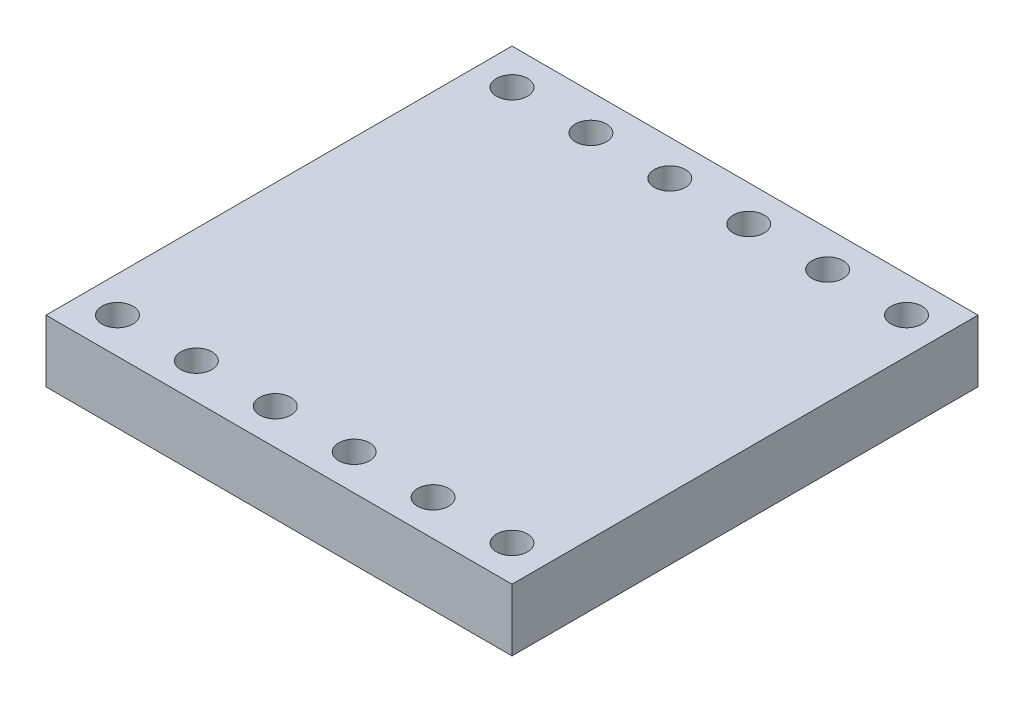
ISO-10303-21;
HEADER;
FILE_DESCRIPTION(('STEP AP214'),'2;1');
FILE_NAME('part.step','',(''),(''),'','','');
FILE_SCHEMA(('AUTOMOTIVE_DESIGN { 1 0 10303 214 1 1 1 1 }'));
ENDSEC;
DATA;
#1=APPLICATION_CONTEXT('core data for automotive mechanical design processes');
#2=APPLICATION_PROTOCOL_DEFINITION('international standard','automotive_design',2000,#1);
#3=PRODUCT_CONTEXT('',#1,'mechanical');
#4=PRODUCT('Part','Part','',(#3));
#5=PRODUCT_RELATED_PRODUCT_CATEGORY('part','',(#4));
#6=PRODUCT_DEFINITION_FORMATION('','',#4);
#7=PRODUCT_DEFINITION_CONTEXT('part definition',#1,'design');
#8=PRODUCT_DEFINITION('design','',#6,#7);
#9=PRODUCT_DEFINITION_SHAPE('','',#8);
#10=(LENGTH_UNIT() NAMED_UNIT(*) SI_UNIT(.MILLI.,.METRE.));
#11=(NAMED_UNIT(*) PLANE_ANGLE_UNIT() SI_UNIT($,.RADIAN.));
#12=(NAMED_UNIT(*) SI_UNIT($,.STERADIAN.) SOLID_ANGLE_UNIT());
#13=UNCERTAINTY_MEASURE_WITH_UNIT(LENGTH_MEASURE(1.E-05),#10,'distance_accuracy_value','');
#14=(GEOMETRIC_REPRESENTATION_CONTEXT(3) GLOBAL_UNCERTAINTY_ASSIGNED_CONTEXT((#13)) GLOBAL_UNIT_ASSIGNED_CONTEXT((#10,
#11,#12)) REPRESENTATION_CONTEXT('',''));
#15=CARTESIAN_POINT('',(0.,0.,0.));
#16=DIRECTION('',(0.,0.,1.));
#17=DIRECTION('',(1.,0.,0.));
#18=AXIS2_PLACEMENT_3D('',#15,#16,#17);
#19=CARTESIAN_POINT('',(0.,2.,0.));
#20=DIRECTION('',(1.,0.,0.));
#21=DIRECTION('',(0.,0.,-1.));
#22=AXIS2_PLACEMENT_3D('',#19,#20,#21);
#23=PLANE('',#22);
#24=DIRECTION('',(0.,0.,1.));
#25=VECTOR('',#24,1.);
#26=CARTESIAN_POINT('',(0.,0.,0.));
#27=LINE('',#26,#25);
#28=CARTESIAN_POINT('',(0.,0.,-15.));
#29=VERTEX_POINT('',#28);
#30=CARTESIAN_POINT('',(0.,0.,0.));
#31=VERTEX_POINT('',#30);
#32=EDGE_CURVE('E101',#29,#31,#27,.T.);
#33=ORIENTED_EDGE('',*,*,#32,.T.);
#34=DIRECTION('',(0.,-1.,0.));
#35=VECTOR('',#34,1.);
#36=CARTESIAN_POINT('',(0.,2.,0.));
#37=LINE('',#36,#35);
#38=CARTESIAN_POINT('',(0.,2.,0.));
#39=VERTEX_POINT('',#38);
#40=EDGE_CURVE('E11',#39,#31,#37,.T.);
#41=ORIENTED_EDGE('',*,*,#40,.F.);
#42=DIRECTION('',(0.,0.,1.));
#43=VECTOR('',#42,1.);
#44=CARTESIAN_POINT('',(0.,2.,0.));
#45=LINE('',#44,#43);
#46=CARTESIAN_POINT('',(0.,2.,-15.));
#47=VERTEX_POINT('',#46);
#48=EDGE_CURVE('E89',#47,#39,#45,.T.);
#49=ORIENTED_EDGE('',*,*,#48,.F.);
#50=DIRECTION('',(0.,-1.,0.));
#51=VECTOR('',#50,1.);
#52=CARTESIAN_POINT('',(0.,2.,-15.));
#53=LINE('',#52,#51);
#54=EDGE_CURVE('E97',#47,#29,#53,.T.);
#55=ORIENTED_EDGE('',*,*,#54,.T.);
#56=EDGE_LOOP('',(#33,#41,#49,#55));
#57=FACE_BOUND('',#56,.T.);
#58=ADVANCED_FACE('F38',(#57),#23,.F.);
#59=CARTESIAN_POINT('',(0.,2.,0.));
#60=DIRECTION('',(0.,0.,-1.));
#61=DIRECTION('',(-1.,0.,0.));
#62=AXIS2_PLACEMENT_3D('',#59,#60,#61);
#63=PLANE('',#62);
#64=DIRECTION('',(1.,0.,0.));
#65=VECTOR('',#64,1.);
#66=CARTESIAN_POINT('',(0.,0.,0.));
#67=LINE('',#66,#65);
#68=CARTESIAN_POINT('',(15.,0.,0.));
#69=VERTEX_POINT('',#68);
#70=EDGE_CURVE('E93',#31,#69,#67,.T.);
#71=ORIENTED_EDGE('',*,*,#70,.T.);
#72=DIRECTION('',(0.,-1.,0.));
#73=VECTOR('',#72,1.);
#74=CARTESIAN_POINT('',(15.,2.,0.));
#75=LINE('',#74,#73);
#76=CARTESIAN_POINT('',(15.,2.,0.));
#77=VERTEX_POINT('',#76);
#78=EDGE_CURVE('E46',#77,#69,#75,.T.);
#79=ORIENTED_EDGE('',*,*,#78,.F.);
#80=DIRECTION('',(1.,0.,0.));
#81=VECTOR('',#80,1.);
#82=CARTESIAN_POINT('',(0.,2.,0.));
#83=LINE('',#82,#81);
#84=EDGE_CURVE('E84',#39,#77,#83,.T.);
#85=ORIENTED_EDGE('',*,*,#84,.F.);
#86=ORIENTED_EDGE('',*,*,#40,.T.);
#87=EDGE_LOOP('',(#71,#79,#85,#86));
#88=FACE_BOUND('',#87,.T.);
#89=ADVANCED_FACE('F92',(#88),#63,.F.);
#90=CARTESIAN_POINT('',(15.,2.,0.));
#91=DIRECTION('',(-1.,0.,0.));
#92=DIRECTION('',(0.,0.,1.));
#93=AXIS2_PLACEMENT_3D('',#90,#91,#92);
#94=PLANE('',#93);
#95=DIRECTION('',(0.,0.,-1.));
#96=VECTOR('',#95,1.);
#97=CARTESIAN_POINT('',(15.,0.,0.));
#98=LINE('',#97,#96);
#99=CARTESIAN_POINT('',(15.,0.,-15.));
#100=VERTEX_POINT('',#99);
#101=EDGE_CURVE('E71',#69,#100,#98,.T.);
#102=ORIENTED_EDGE('',*,*,#101,.T.);
#103=DIRECTION('',(0.,-1.,0.));
#104=VECTOR('',#103,1.);
#105=CARTESIAN_POINT('',(15.,2.,-15.));
#106=LINE('',#105,#104);
#107=CARTESIAN_POINT('',(15.,2.,-15.));
#108=VERTEX_POINT('',#107);
#109=EDGE_CURVE('E94',#108,#100,#106,.T.);
#110=ORIENTED_EDGE('',*,*,#109,.F.);
#111=DIRECTION('',(0.,0.,-1.));
#112=VECTOR('',#111,1.);
#113=CARTESIAN_POINT('',(15.,2.,0.));
#114=LINE('',#113,#112);
#115=EDGE_CURVE('E87',#77,#108,#114,.T.);
#116=ORIENTED_EDGE('',*,*,#115,.F.);
#117=ORIENTED_EDGE('',*,*,#78,.T.);
#118=EDGE_LOOP('',(#102,#110,#116,#117));
#119=FACE_BOUND('',#118,.T.);
#120=ADVANCED_FACE('F95',(#119),#94,.F.);
#121=CARTESIAN_POINT('',(0.,2.,-15.));
#122=DIRECTION('',(0.,0.,1.));
#123=DIRECTION('',(1.,0.,0.));
#124=AXIS2_PLACEMENT_3D('',#121,#122,#123);
#125=PLANE('',#124);
#126=DIRECTION('',(-1.,0.,0.));
#127=VECTOR('',#126,1.);
#128=CARTESIAN_POINT('',(0.,0.,-15.));
#129=LINE('',#128,#127);
#130=EDGE_CURVE('E77',#100,#29,#129,.T.);
#131=ORIENTED_EDGE('',*,*,#130,.T.);
#132=ORIENTED_EDGE('',*,*,#54,.F.);
#133=DIRECTION('',(-1.,0.,0.));
#134=VECTOR('',#133,1.);
#135=CARTESIAN_POINT('',(0.,2.,-15.));
#136=LINE('',#135,#134);
#137=EDGE_CURVE('E54',#108,#47,#136,.T.);
#138=ORIENTED_EDGE('',*,*,#137,.F.);
#139=ORIENTED_EDGE('',*,*,#109,.T.);
#140=EDGE_LOOP('',(#131,#132,#138,#139));
#141=FACE_BOUND('',#140,.T.);
#142=ADVANCED_FACE('F109',(#141),#125,.F.);
#143=CARTESIAN_POINT('',(0.,2.,0.));
#144=DIRECTION('',(0.,-1.,0.));
#145=DIRECTION('',(0.,0.,-1.));
#146=AXIS2_PLACEMENT_3D('',#143,#144,#145);
#147=PLANE('',#146);
#148=CARTESIAN_POINT('',(1.15,2.,-1.15));
#149=DIRECTION('',(0.,1.,0.));
#150=DIRECTION('',(0.,0.,1.));
#151=AXIS2_PLACEMENT_3D('',#148,#149,#150);
#152=CIRCLE('',#151,0.5);
#153=CARTESIAN_POINT('',(1.15,2.,-0.65));
#154=VERTEX_POINT('',#153);
#155=EDGE_CURVE('E148',#154,#154,#152,.T.);
#156=ORIENTED_EDGE('',*,*,#155,.F.);
#157=EDGE_LOOP('',(#156));
#158=FACE_BOUND('',#157,.T.);
#159=CARTESIAN_POINT('',(13.85,2.,-13.85));
#160=DIRECTION('',(0.,1.,0.));
#161=DIRECTION('',(0.,0.,1.));
#162=AXIS2_PLACEMENT_3D('',#159,#160,#161);
#163=CIRCLE('',#162,0.500000000000001);
#164=CARTESIAN_POINT('',(13.85,2.,-13.35));
#165=VERTEX_POINT('',#164);
#166=EDGE_CURVE('E149',#165,#165,#163,.T.);
#167=ORIENTED_EDGE('',*,*,#166,.F.);
#168=EDGE_LOOP('',(#167));
#169=FACE_BOUND('',#168,.T.);
#170=CARTESIAN_POINT('',(11.31,2.,-13.85));
#171=DIRECTION('',(0.,1.,0.));
#172=DIRECTION('',(0.,0.,1.));
#173=AXIS2_PLACEMENT_3D('',#170,#171,#172);
#174=CIRCLE('',#173,0.500000000000001);
#175=CARTESIAN_POINT('',(11.31,2.,-13.35));
#176=VERTEX_POINT('',#175);
#177=EDGE_CURVE('E160',#176,#176,#174,.T.);
#178=ORIENTED_EDGE('',*,*,#177,.F.);
#179=EDGE_LOOP('',(#178));
#180=FACE_BOUND('',#179,.T.);
#181=CARTESIAN_POINT('',(8.77,2.,-13.85));
#182=DIRECTION('',(0.,1.,0.));
#183=DIRECTION('',(0.,0.,1.));
#184=AXIS2_PLACEMENT_3D('',#181,#182,#183);
#185=CIRCLE('',#184,0.500000000000001);
#186=CARTESIAN_POINT('',(8.77,2.,-13.35));
#187=VERTEX_POINT('',#186);
#188=EDGE_CURVE('E161',#187,#187,#185,.T.);
#189=ORIENTED_EDGE('',*,*,#188,.F.);
#190=EDGE_LOOP('',(#189));
#191=FACE_BOUND('',#190,.T.);
#192=CARTESIAN_POINT('',(3.69,2.,-1.15));
#193=DIRECTION('',(0.,1.,0.));
#194=DIRECTION('',(0.,0.,1.));
#195=AXIS2_PLACEMENT_3D('',#192,#193,#194);
#196=CIRCLE('',#195,0.500000000000001);
#197=CARTESIAN_POINT('',(3.69,2.,-0.65));
#198=VERTEX_POINT('',#197);
#199=EDGE_CURVE('E125',#198,#198,#196,.T.);
#200=ORIENTED_EDGE('',*,*,#199,.F.);
#201=EDGE_LOOP('',(#200));
#202=FACE_BOUND('',#201,.T.);
#203=CARTESIAN_POINT('',(6.23,2.,-1.15));
#204=DIRECTION('',(0.,1.,0.));
#205=DIRECTION('',(0.,0.,1.));
#206=AXIS2_PLACEMENT_3D('',#203,#204,#205);
#207=CIRCLE('',#206,0.500000000000001);
#208=CARTESIAN_POINT('',(6.23,2.,-0.65));
#209=VERTEX_POINT('',#208);
#210=EDGE_CURVE('E124',#209,#209,#207,.T.);
#211=ORIENTED_EDGE('',*,*,#210,.F.);
#212=EDGE_LOOP('',(#211));
#213=FACE_BOUND('',#212,.T.);
#214=CARTESIAN_POINT('',(8.77,2.,-1.15));
#215=DIRECTION('',(0.,1.,0.));
#216=DIRECTION('',(0.,0.,1.));
#217=AXIS2_PLACEMENT_3D('',#214,#215,#216);
#218=CIRCLE('',#217,0.500000000000001);
#219=CARTESIAN_POINT('',(8.77,2.,-0.65));
#220=VERTEX_POINT('',#219);
#221=EDGE_CURVE('E132',#220,#220,#218,.T.);
#222=ORIENTED_EDGE('',*,*,#221,.F.);
#223=EDGE_LOOP('',(#222));
#224=FACE_BOUND('',#223,.T.);
#225=CARTESIAN_POINT('',(11.31,2.,-1.15));
#226=DIRECTION('',(0.,1.,0.));
#227=DIRECTION('',(0.,0.,1.));
#228=AXIS2_PLACEMENT_3D('',#225,#226,#227);
#229=CIRCLE('',#228,0.500000000000001);
#230=CARTESIAN_POINT('',(11.31,2.,-0.65));
#231=VERTEX_POINT('',#230);
#232=EDGE_CURVE('E138',#231,#231,#229,.T.);
#233=ORIENTED_EDGE('',*,*,#232,.F.);
#234=EDGE_LOOP('',(#233));
#235=FACE_BOUND('',#234,.T.);
#236=CARTESIAN_POINT('',(6.23,2.,-13.85));
#237=DIRECTION('',(0.,1.,0.));
#238=DIRECTION('',(0.,0.,1.));
#239=AXIS2_PLACEMENT_3D('',#236,#237,#238);
#240=CIRCLE('',#239,0.500000000000001);
#241=CARTESIAN_POINT('',(6.23,2.,-13.35));
#242=VERTEX_POINT('',#241);
#243=EDGE_CURVE('E179',#242,#242,#240,.T.);
#244=ORIENTED_EDGE('',*,*,#243,.F.);
#245=EDGE_LOOP('',(#244));
#246=FACE_BOUND('',#245,.T.);
#247=CARTESIAN_POINT('',(3.69,2.,-13.85));
#248=DIRECTION('',(0.,1.,0.));
#249=DIRECTION('',(0.,0.,1.));
#250=AXIS2_PLACEMENT_3D('',#247,#248,#249);
#251=CIRCLE('',#250,0.500000000000001);
#252=CARTESIAN_POINT('',(3.69,2.,-13.35));
#253=VERTEX_POINT('',#252);
#254=EDGE_CURVE('E172',#253,#253,#251,.T.);
#255=ORIENTED_EDGE('',*,*,#254,.F.);
#256=EDGE_LOOP('',(#255));
#257=FACE_BOUND('',#256,.T.);
#258=CARTESIAN_POINT('',(1.15,2.,-13.85));
#259=DIRECTION('',(0.,1.,0.));
#260=DIRECTION('',(0.,0.,1.));
#261=AXIS2_PLACEMENT_3D('',#258,#259,#260);
#262=CIRCLE('',#261,0.5);
#263=CARTESIAN_POINT('',(1.15,2.,-13.35));
#264=VERTEX_POINT('',#263);
#265=EDGE_CURVE('E173',#264,#264,#262,.T.);
#266=ORIENTED_EDGE('',*,*,#265,.F.);
#267=EDGE_LOOP('',(#266));
#268=FACE_BOUND('',#267,.T.);
#269=CARTESIAN_POINT('',(13.85,2.,-1.15));
#270=DIRECTION('',(0.,1.,0.));
#271=DIRECTION('',(0.,0.,1.));
#272=AXIS2_PLACEMENT_3D('',#269,#270,#271);
#273=CIRCLE('',#272,0.500000000000001);
#274=CARTESIAN_POINT('',(13.85,2.,-0.65));
#275=VERTEX_POINT('',#274);
#276=EDGE_CURVE('E117',#275,#275,#273,.T.);
#277=ORIENTED_EDGE('',*,*,#276,.F.);
#278=EDGE_LOOP('',(#277));
#279=FACE_BOUND('',#278,.T.);
#280=ORIENTED_EDGE('',*,*,#48,.T.);
#281=ORIENTED_EDGE('',*,*,#84,.T.);
#282=ORIENTED_EDGE('',*,*,#115,.T.);
#283=ORIENTED_EDGE('',*,*,#137,.T.);
#284=EDGE_LOOP('',(#280,#281,#282,#283));
#285=FACE_BOUND('',#284,.T.);
#286=ADVANCED_FACE('F85',(#158,#169,#180,#191,#202,#213,#224,#235,#246,#257,#268,#279,#285),
#147,.F.);
#287=CARTESIAN_POINT('',(0.,0.,0.));
#288=DIRECTION('',(0.,-1.,0.));
#289=DIRECTION('',(0.,0.,-1.));
#290=AXIS2_PLACEMENT_3D('',#287,#288,#289);
#291=PLANE('',#290);
#292=CARTESIAN_POINT('',(1.15,0.,-1.15));
#293=DIRECTION('',(0.,-1.,0.));
#294=DIRECTION('',(0.,0.,-1.));
#295=AXIS2_PLACEMENT_3D('',#292,#293,#294);
#296=CIRCLE('',#295,0.5);
#297=CARTESIAN_POINT('',(1.15,0.,-1.65));
#298=VERTEX_POINT('',#297);
#299=EDGE_CURVE('E128',#298,#298,#296,.F.);
#300=ORIENTED_EDGE('',*,*,#299,.T.);
#301=EDGE_LOOP('',(#300));
#302=FACE_BOUND('',#301,.T.);
#303=CARTESIAN_POINT('',(13.85,0.,-13.85));
#304=DIRECTION('',(0.,-1.,0.));
#305=DIRECTION('',(0.,0.,-1.));
#306=AXIS2_PLACEMENT_3D('',#303,#304,#305);
#307=CIRCLE('',#306,0.500000000000001);
#308=CARTESIAN_POINT('',(13.85,0.,-14.35));
#309=VERTEX_POINT('',#308);
#310=EDGE_CURVE('E145',#309,#309,#307,.F.);
#311=ORIENTED_EDGE('',*,*,#310,.T.);
#312=EDGE_LOOP('',(#311));
#313=FACE_BOUND('',#312,.T.);
#314=CARTESIAN_POINT('',(11.31,0.,-13.85));
#315=DIRECTION('',(0.,-1.,0.));
#316=DIRECTION('',(0.,0.,-1.));
#317=AXIS2_PLACEMENT_3D('',#314,#315,#316);
#318=CIRCLE('',#317,0.500000000000001);
#319=CARTESIAN_POINT('',(11.31,0.,-14.35));
#320=VERTEX_POINT('',#319);
#321=EDGE_CURVE('E152',#320,#320,#318,.F.);
#322=ORIENTED_EDGE('',*,*,#321,.T.);
#323=EDGE_LOOP('',(#322));
#324=FACE_BOUND('',#323,.T.);
#325=CARTESIAN_POINT('',(8.77,0.,-13.85));
#326=DIRECTION('',(0.,-1.,0.));
#327=DIRECTION('',(0.,0.,-1.));
#328=AXIS2_PLACEMENT_3D('',#325,#326,#327);
#329=CIRCLE('',#328,0.500000000000001);
#330=CARTESIAN_POINT('',(8.77,0.,-14.35));
#331=VERTEX_POINT('',#330);
#332=EDGE_CURVE('E157',#331,#331,#329,.F.);
#333=ORIENTED_EDGE('',*,*,#332,.T.);
#334=EDGE_LOOP('',(#333));
#335=FACE_BOUND('',#334,.T.);
#336=CARTESIAN_POINT('',(3.69,0.,-1.15));
#337=DIRECTION('',(0.,-1.,0.));
#338=DIRECTION('',(0.,0.,-1.));
#339=AXIS2_PLACEMENT_3D('',#336,#337,#338);
#340=CIRCLE('',#339,0.500000000000001);
#341=CARTESIAN_POINT('',(3.69,0.,-1.65));
#342=VERTEX_POINT('',#341);
#343=EDGE_CURVE('E121',#342,#342,#340,.F.);
#344=ORIENTED_EDGE('',*,*,#343,.T.);
#345=EDGE_LOOP('',(#344));
#346=FACE_BOUND('',#345,.T.);
#347=CARTESIAN_POINT('',(6.23,0.,-1.15));
#348=DIRECTION('',(0.,-1.,0.));
#349=DIRECTION('',(0.,0.,-1.));
#350=AXIS2_PLACEMENT_3D('',#347,#348,#349);
#351=CIRCLE('',#350,0.500000000000001);
#352=CARTESIAN_POINT('',(6.23,0.,-1.65));
#353=VERTEX_POINT('',#352);
#354=EDGE_CURVE('E129',#353,#353,#351,.F.);
#355=ORIENTED_EDGE('',*,*,#354,.T.);
#356=EDGE_LOOP('',(#355));
#357=FACE_BOUND('',#356,.T.);
#358=CARTESIAN_POINT('',(8.77,0.,-1.15));
#359=DIRECTION('',(0.,-1.,0.));
#360=DIRECTION('',(0.,0.,-1.));
#361=AXIS2_PLACEMENT_3D('',#358,#359,#360);
#362=CIRCLE('',#361,0.500000000000001);
#363=CARTESIAN_POINT('',(8.77,0.,-1.65));
#364=VERTEX_POINT('',#363);
#365=EDGE_CURVE('E135',#364,#364,#362,.F.);
#366=ORIENTED_EDGE('',*,*,#365,.T.);
#367=EDGE_LOOP('',(#366));
#368=FACE_BOUND('',#367,.T.);
#369=CARTESIAN_POINT('',(11.31,0.,-1.15));
#370=DIRECTION('',(0.,-1.,0.));
#371=DIRECTION('',(0.,0.,-1.));
#372=AXIS2_PLACEMENT_3D('',#369,#370,#371);
#373=CIRCLE('',#372,0.500000000000001);
#374=CARTESIAN_POINT('',(11.31,0.,-1.65));
#375=VERTEX_POINT('',#374);
#376=EDGE_CURVE('E120',#375,#375,#373,.F.);
#377=ORIENTED_EDGE('',*,*,#376,.T.);
#378=EDGE_LOOP('',(#377));
#379=FACE_BOUND('',#378,.T.);
#380=CARTESIAN_POINT('',(6.23,0.,-13.85));
#381=DIRECTION('',(0.,-1.,0.));
#382=DIRECTION('',(0.,0.,-1.));
#383=AXIS2_PLACEMENT_3D('',#380,#381,#382);
#384=CIRCLE('',#383,0.500000000000001);
#385=CARTESIAN_POINT('',(6.23,0.,-14.35));
#386=VERTEX_POINT('',#385);
#387=EDGE_CURVE('E164',#386,#386,#384,.F.);
#388=ORIENTED_EDGE('',*,*,#387,.T.);
#389=EDGE_LOOP('',(#388));
#390=FACE_BOUND('',#389,.T.);
#391=CARTESIAN_POINT('',(3.69,0.,-13.85));
#392=DIRECTION('',(0.,-1.,0.));
#393=DIRECTION('',(0.,0.,-1.));
#394=AXIS2_PLACEMENT_3D('',#391,#392,#393);
#395=CIRCLE('',#394,0.500000000000001);
#396=CARTESIAN_POINT('',(3.69,0.,-14.35));
#397=VERTEX_POINT('',#396);
#398=EDGE_CURVE('E176',#397,#397,#395,.F.);
#399=ORIENTED_EDGE('',*,*,#398,.T.);
#400=EDGE_LOOP('',(#399));
#401=FACE_BOUND('',#400,.T.);
#402=CARTESIAN_POINT('',(1.15,0.,-13.85));
#403=DIRECTION('',(0.,-1.,0.));
#404=DIRECTION('',(0.,0.,-1.));
#405=AXIS2_PLACEMENT_3D('',#402,#403,#404);
#406=CIRCLE('',#405,0.5);
#407=CARTESIAN_POINT('',(1.15,0.,-14.35));
#408=VERTEX_POINT('',#407);
#409=EDGE_CURVE('E169',#408,#408,#406,.F.);
#410=ORIENTED_EDGE('',*,*,#409,.T.);
#411=EDGE_LOOP('',(#410));
#412=FACE_BOUND('',#411,.T.);
#413=CARTESIAN_POINT('',(13.85,0.,-1.15));
#414=DIRECTION('',(0.,-1.,0.));
#415=DIRECTION('',(0.,0.,-1.));
#416=AXIS2_PLACEMENT_3D('',#413,#414,#415);
#417=CIRCLE('',#416,0.500000000000001);
#418=CARTESIAN_POINT('',(13.85,0.,-1.65));
#419=VERTEX_POINT('',#418);
#420=EDGE_CURVE('E104',#419,#419,#417,.F.);
#421=ORIENTED_EDGE('',*,*,#420,.T.);
#422=EDGE_LOOP('',(#421));
#423=FACE_BOUND('',#422,.T.);
#424=ORIENTED_EDGE('',*,*,#32,.F.);
#425=ORIENTED_EDGE('',*,*,#130,.F.);
#426=ORIENTED_EDGE('',*,*,#101,.F.);
#427=ORIENTED_EDGE('',*,*,#70,.F.);
#428=EDGE_LOOP('',(#424,#425,#426,#427));
#429=FACE_BOUND('',#428,.T.);
#430=ADVANCED_FACE('F112',(#302,#313,#324,#335,#346,#357,#368,#379,#390,#401,#412,#423,#429),
#291,.T.);
#431=CARTESIAN_POINT('',(13.85,-1.4142135623731,-1.15));
#432=DIRECTION('',(0.,1.,0.));
#433=DIRECTION('',(0.,0.,1.));
#434=AXIS2_PLACEMENT_3D('',#431,#432,#433);
#435=CYLINDRICAL_SURFACE('',#434,0.500000000000001);
#436=ORIENTED_EDGE('',*,*,#276,.T.);
#437=EDGE_LOOP('',(#436));
#438=FACE_BOUND('',#437,.T.);
#439=ORIENTED_EDGE('',*,*,#420,.F.);
#440=EDGE_LOOP('',(#439));
#441=FACE_BOUND('',#440,.T.);
#442=ADVANCED_FACE('F200',(#438,#441),#435,.F.);
#443=CARTESIAN_POINT('',(1.15,-1.4142135623731,-13.85));
#444=DIRECTION('',(0.,1.,0.));
#445=DIRECTION('',(0.,0.,1.));
#446=AXIS2_PLACEMENT_3D('',#443,#444,#445);
#447=CYLINDRICAL_SURFACE('',#446,0.5);
#448=ORIENTED_EDGE('',*,*,#265,.T.);
#449=EDGE_LOOP('',(#448));
#450=FACE_BOUND('',#449,.T.);
#451=ORIENTED_EDGE('',*,*,#409,.F.);
#452=EDGE_LOOP('',(#451));
#453=FACE_BOUND('',#452,.T.);
#454=ADVANCED_FACE('F203',(#450,#453),#447,.F.);
#455=CARTESIAN_POINT('',(3.69,-1.4142135623731,-13.85));
#456=DIRECTION('',(0.,1.,0.));
#457=DIRECTION('',(0.,0.,1.));
#458=AXIS2_PLACEMENT_3D('',#455,#456,#457);
#459=CYLINDRICAL_SURFACE('',#458,0.500000000000001);
#460=ORIENTED_EDGE('',*,*,#254,.T.);
#461=EDGE_LOOP('',(#460));
#462=FACE_BOUND('',#461,.T.);
#463=ORIENTED_EDGE('',*,*,#398,.F.);
#464=EDGE_LOOP('',(#463));
#465=FACE_BOUND('',#464,.T.);
#466=ADVANCED_FACE('F250',(#462,#465),#459,.F.);
#467=CARTESIAN_POINT('',(6.23,-1.4142135623731,-13.85));
#468=DIRECTION('',(0.,1.,0.));
#469=DIRECTION('',(0.,0.,1.));
#470=AXIS2_PLACEMENT_3D('',#467,#468,#469);
#471=CYLINDRICAL_SURFACE('',#470,0.500000000000001);
#472=ORIENTED_EDGE('',*,*,#243,.T.);
#473=EDGE_LOOP('',(#472));
#474=FACE_BOUND('',#473,.T.);
#475=ORIENTED_EDGE('',*,*,#387,.F.);
#476=EDGE_LOOP('',(#475));
#477=FACE_BOUND('',#476,.T.);
#478=ADVANCED_FACE('F187',(#474,#477),#471,.F.);
#479=CARTESIAN_POINT('',(11.31,-1.4142135623731,-1.15));
#480=DIRECTION('',(0.,1.,0.));
#481=DIRECTION('',(0.,0.,1.));
#482=AXIS2_PLACEMENT_3D('',#479,#480,#481);
#483=CYLINDRICAL_SURFACE('',#482,0.500000000000001);
#484=ORIENTED_EDGE('',*,*,#232,.T.);
#485=EDGE_LOOP('',(#484));
#486=FACE_BOUND('',#485,.T.);
#487=ORIENTED_EDGE('',*,*,#376,.F.);
#488=EDGE_LOOP('',(#487));
#489=FACE_BOUND('',#488,.T.);
#490=ADVANCED_FACE('F269',(#486,#489),#483,.F.);
#491=CARTESIAN_POINT('',(8.77,-1.4142135623731,-1.15));
#492=DIRECTION('',(0.,1.,0.));
#493=DIRECTION('',(0.,0.,1.));
#494=AXIS2_PLACEMENT_3D('',#491,#492,#493);
#495=CYLINDRICAL_SURFACE('',#494,0.500000000000001);
#496=ORIENTED_EDGE('',*,*,#221,.T.);
#497=EDGE_LOOP('',(#496));
#498=FACE_BOUND('',#497,.T.);
#499=ORIENTED_EDGE('',*,*,#365,.F.);
#500=EDGE_LOOP('',(#499));
#501=FACE_BOUND('',#500,.T.);
#502=ADVANCED_FACE('F278',(#498,#501),#495,.F.);
#503=CARTESIAN_POINT('',(6.23,-1.4142135623731,-1.15));
#504=DIRECTION('',(0.,1.,0.));
#505=DIRECTION('',(0.,0.,1.));
#506=AXIS2_PLACEMENT_3D('',#503,#504,#505);
#507=CYLINDRICAL_SURFACE('',#506,0.500000000000001);
#508=ORIENTED_EDGE('',*,*,#210,.T.);
#509=EDGE_LOOP('',(#508));
#510=FACE_BOUND('',#509,.T.);
#511=ORIENTED_EDGE('',*,*,#354,.F.);
#512=EDGE_LOOP('',(#511));
#513=FACE_BOUND('',#512,.T.);
#514=ADVANCED_FACE('F288',(#510,#513),#507,.F.);
#515=CARTESIAN_POINT('',(3.69,-1.4142135623731,-1.15));
#516=DIRECTION('',(0.,1.,0.));
#517=DIRECTION('',(0.,0.,1.));
#518=AXIS2_PLACEMENT_3D('',#515,#516,#517);
#519=CYLINDRICAL_SURFACE('',#518,0.500000000000001);
#520=ORIENTED_EDGE('',*,*,#199,.T.);
#521=EDGE_LOOP('',(#520));
#522=FACE_BOUND('',#521,.T.);
#523=ORIENTED_EDGE('',*,*,#343,.F.);
#524=EDGE_LOOP('',(#523));
#525=FACE_BOUND('',#524,.T.);
#526=ADVANCED_FACE('F298',(#522,#525),#519,.F.);
#527=CARTESIAN_POINT('',(8.77,-1.4142135623731,-13.85));
#528=DIRECTION('',(0.,1.,0.));
#529=DIRECTION('',(0.,0.,1.));
#530=AXIS2_PLACEMENT_3D('',#527,#528,#529);
#531=CYLINDRICAL_SURFACE('',#530,0.500000000000001);
#532=ORIENTED_EDGE('',*,*,#188,.T.);
#533=EDGE_LOOP('',(#532));
#534=FACE_BOUND('',#533,.T.);
#535=ORIENTED_EDGE('',*,*,#332,.F.);
#536=EDGE_LOOP('',(#535));
#537=FACE_BOUND('',#536,.T.);
#538=ADVANCED_FACE('F308',(#534,#537),#531,.F.);
#539=CARTESIAN_POINT('',(11.31,-1.4142135623731,-13.85));
#540=DIRECTION('',(0.,1.,0.));
#541=DIRECTION('',(0.,0.,1.));
#542=AXIS2_PLACEMENT_3D('',#539,#540,#541);
#543=CYLINDRICAL_SURFACE('',#542,0.500000000000001);
#544=ORIENTED_EDGE('',*,*,#177,.T.);
#545=EDGE_LOOP('',(#544));
#546=FACE_BOUND('',#545,.T.);
#547=ORIENTED_EDGE('',*,*,#321,.F.);
#548=EDGE_LOOP('',(#547));
#549=FACE_BOUND('',#548,.T.);
#550=ADVANCED_FACE('F318',(#546,#549),#543,.F.);
#551=CARTESIAN_POINT('',(13.85,-1.4142135623731,-13.85));
#552=DIRECTION('',(0.,1.,0.));
#553=DIRECTION('',(0.,0.,1.));
#554=AXIS2_PLACEMENT_3D('',#551,#552,#553);
#555=CYLINDRICAL_SURFACE('',#554,0.500000000000001);
#556=ORIENTED_EDGE('',*,*,#166,.T.);
#557=EDGE_LOOP('',(#556));
#558=FACE_BOUND('',#557,.T.);
#559=ORIENTED_EDGE('',*,*,#310,.F.);
#560=EDGE_LOOP('',(#559));
#561=FACE_BOUND('',#560,.T.);
#562=ADVANCED_FACE('F328',(#558,#561),#555,.F.);
#563=CARTESIAN_POINT('',(1.15,-1.4142135623731,-1.15));
#564=DIRECTION('',(0.,1.,0.));
#565=DIRECTION('',(0.,0.,1.));
#566=AXIS2_PLACEMENT_3D('',#563,#564,#565);
#567=CYLINDRICAL_SURFACE('',#566,0.5);
#568=ORIENTED_EDGE('',*,*,#155,.T.);
#569=EDGE_LOOP('',(#568));
#570=FACE_BOUND('',#569,.T.);
#571=ORIENTED_EDGE('',*,*,#299,.F.);
#572=EDGE_LOOP('',(#571));
#573=FACE_BOUND('',#572,.T.);
#574=ADVANCED_FACE('F338',(#570,#573),#567,.F.);
#575=CLOSED_SHELL('',(#58,#89,#120,#142,#286,#430,#442,#454,#466,#478,#490,#502,#514,#526,#538,
#550,#562,#574));
#576=MANIFOLD_SOLID_BREP('B2',#575);
#577=ADVANCED_BREP_SHAPE_REPRESENTATION('',(#18,#576),#14);
#578=SHAPE_DEFINITION_REPRESENTATION(#9,#577);
ENDSEC;
END-ISO-10303-21;
